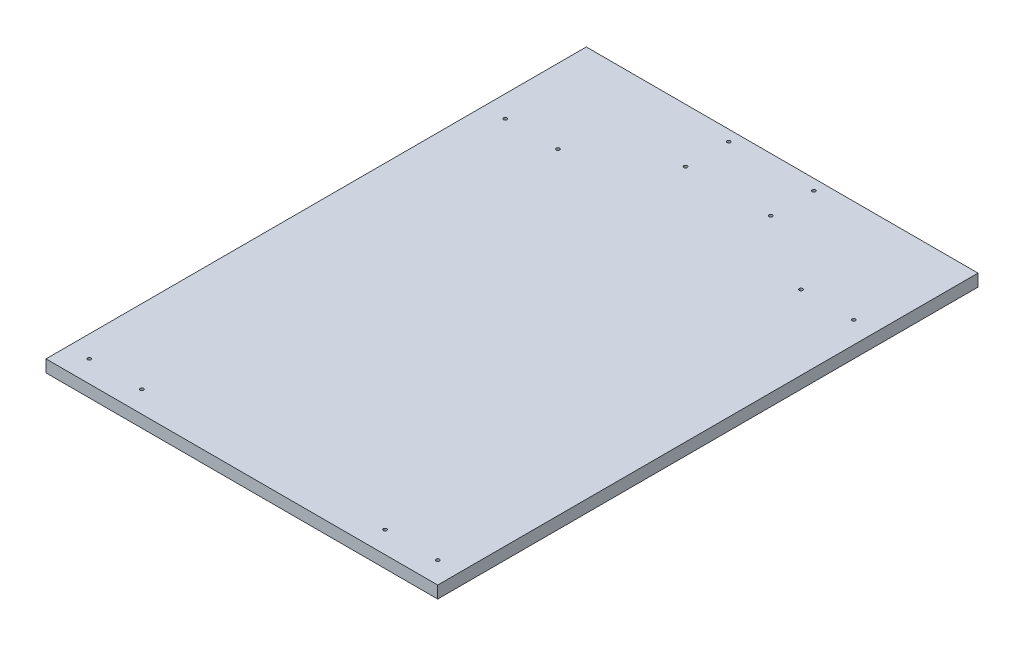
ISO-10303-21;
HEADER;
FILE_DESCRIPTION(('STEP AP214'),'2;1');
FILE_NAME('part.step','',(''),(''),'','','');
FILE_SCHEMA(('AUTOMOTIVE_DESIGN { 1 0 10303 214 1 1 1 1 }'));
ENDSEC;
DATA;
#1=APPLICATION_CONTEXT('core data for automotive mechanical design processes');
#2=APPLICATION_PROTOCOL_DEFINITION('international standard','automotive_design',2000,#1);
#3=PRODUCT_CONTEXT('',#1,'mechanical');
#4=PRODUCT('Part','Part','',(#3));
#5=PRODUCT_RELATED_PRODUCT_CATEGORY('part','',(#4));
#6=PRODUCT_DEFINITION_FORMATION('','',#4);
#7=PRODUCT_DEFINITION_CONTEXT('part definition',#1,'design');
#8=PRODUCT_DEFINITION('design','',#6,#7);
#9=PRODUCT_DEFINITION_SHAPE('','',#8);
#10=(LENGTH_UNIT() NAMED_UNIT(*) SI_UNIT(.MILLI.,.METRE.));
#11=(NAMED_UNIT(*) PLANE_ANGLE_UNIT() SI_UNIT($,.RADIAN.));
#12=(NAMED_UNIT(*) SI_UNIT($,.STERADIAN.) SOLID_ANGLE_UNIT());
#13=UNCERTAINTY_MEASURE_WITH_UNIT(LENGTH_MEASURE(1.E-05),#10,'distance_accuracy_value','');
#14=(GEOMETRIC_REPRESENTATION_CONTEXT(3) GLOBAL_UNCERTAINTY_ASSIGNED_CONTEXT((#13)) GLOBAL_UNIT_ASSIGNED_CONTEXT((#10,
#11,#12)) REPRESENTATION_CONTEXT('',''));
#15=CARTESIAN_POINT('',(0.,0.,0.));
#16=DIRECTION('',(0.,0.,1.));
#17=DIRECTION('',(1.,0.,0.));
#18=AXIS2_PLACEMENT_3D('',#15,#16,#17);
#19=CARTESIAN_POINT('',(0.,9.,0.));
#20=DIRECTION('',(1.,0.,0.));
#21=DIRECTION('',(0.,0.,-1.));
#22=AXIS2_PLACEMENT_3D('',#19,#20,#21);
#23=PLANE('',#22);
#24=DIRECTION('',(0.,0.,1.));
#25=VECTOR('',#24,1.);
#26=CARTESIAN_POINT('',(0.,0.,0.));
#27=LINE('',#26,#25);
#28=CARTESIAN_POINT('',(0.,0.,-400.));
#29=VERTEX_POINT('',#28);
#30=CARTESIAN_POINT('',(0.,0.,0.));
#31=VERTEX_POINT('',#30);
#32=EDGE_CURVE('E96',#29,#31,#27,.T.);
#33=ORIENTED_EDGE('',*,*,#32,.T.);
#34=DIRECTION('',(0.,-1.,0.));
#35=VECTOR('',#34,1.);
#36=CARTESIAN_POINT('',(0.,9.,0.));
#37=LINE('',#36,#35);
#38=CARTESIAN_POINT('',(0.,9.,0.));
#39=VERTEX_POINT('',#38);
#40=EDGE_CURVE('E11',#39,#31,#37,.T.);
#41=ORIENTED_EDGE('',*,*,#40,.F.);
#42=DIRECTION('',(0.,0.,1.));
#43=VECTOR('',#42,1.);
#44=CARTESIAN_POINT('',(0.,9.,0.));
#45=LINE('',#44,#43);
#46=CARTESIAN_POINT('',(0.,9.,-400.));
#47=VERTEX_POINT('',#46);
#48=EDGE_CURVE('E84',#47,#39,#45,.T.);
#49=ORIENTED_EDGE('',*,*,#48,.F.);
#50=DIRECTION('',(0.,-1.,0.));
#51=VECTOR('',#50,1.);
#52=CARTESIAN_POINT('',(0.,9.,-400.));
#53=LINE('',#52,#51);
#54=EDGE_CURVE('E92',#47,#29,#53,.T.);
#55=ORIENTED_EDGE('',*,*,#54,.T.);
#56=EDGE_LOOP('',(#33,#41,#49,#55));
#57=FACE_BOUND('',#56,.T.);
#58=ADVANCED_FACE('F33',(#57),#23,.F.);
#59=CARTESIAN_POINT('',(0.,9.,0.));
#60=DIRECTION('',(0.,0.,-1.));
#61=DIRECTION('',(-1.,0.,0.));
#62=AXIS2_PLACEMENT_3D('',#59,#60,#61);
#63=PLANE('',#62);
#64=DIRECTION('',(1.,0.,0.));
#65=VECTOR('',#64,1.);
#66=CARTESIAN_POINT('',(0.,0.,0.));
#67=LINE('',#66,#65);
#68=CARTESIAN_POINT('',(290.,0.,0.));
#69=VERTEX_POINT('',#68);
#70=EDGE_CURVE('E88',#31,#69,#67,.T.);
#71=ORIENTED_EDGE('',*,*,#70,.T.);
#72=DIRECTION('',(0.,-1.,0.));
#73=VECTOR('',#72,1.);
#74=CARTESIAN_POINT('',(290.,9.,0.));
#75=LINE('',#74,#73);
#76=CARTESIAN_POINT('',(290.,9.,0.));
#77=VERTEX_POINT('',#76);
#78=EDGE_CURVE('E41',#77,#69,#75,.T.);
#79=ORIENTED_EDGE('',*,*,#78,.F.);
#80=DIRECTION('',(1.,0.,0.));
#81=VECTOR('',#80,1.);
#82=CARTESIAN_POINT('',(0.,9.,0.));
#83=LINE('',#82,#81);
#84=EDGE_CURVE('E79',#39,#77,#83,.T.);
#85=ORIENTED_EDGE('',*,*,#84,.F.);
#86=ORIENTED_EDGE('',*,*,#40,.T.);
#87=EDGE_LOOP('',(#71,#79,#85,#86));
#88=FACE_BOUND('',#87,.T.);
#89=ADVANCED_FACE('F87',(#88),#63,.F.);
#90=CARTESIAN_POINT('',(290.,9.,0.));
#91=DIRECTION('',(-1.,0.,0.));
#92=DIRECTION('',(0.,0.,1.));
#93=AXIS2_PLACEMENT_3D('',#90,#91,#92);
#94=PLANE('',#93);
#95=DIRECTION('',(0.,0.,-1.));
#96=VECTOR('',#95,1.);
#97=CARTESIAN_POINT('',(290.,0.,0.));
#98=LINE('',#97,#96);
#99=CARTESIAN_POINT('',(290.,0.,-400.));
#100=VERTEX_POINT('',#99);
#101=EDGE_CURVE('E66',#69,#100,#98,.T.);
#102=ORIENTED_EDGE('',*,*,#101,.T.);
#103=DIRECTION('',(0.,-1.,0.));
#104=VECTOR('',#103,1.);
#105=CARTESIAN_POINT('',(290.,9.,-400.));
#106=LINE('',#105,#104);
#107=CARTESIAN_POINT('',(290.,9.,-400.));
#108=VERTEX_POINT('',#107);
#109=EDGE_CURVE('E89',#108,#100,#106,.T.);
#110=ORIENTED_EDGE('',*,*,#109,.F.);
#111=DIRECTION('',(0.,0.,-1.));
#112=VECTOR('',#111,1.);
#113=CARTESIAN_POINT('',(290.,9.,0.));
#114=LINE('',#113,#112);
#115=EDGE_CURVE('E82',#77,#108,#114,.T.);
#116=ORIENTED_EDGE('',*,*,#115,.F.);
#117=ORIENTED_EDGE('',*,*,#78,.T.);
#118=EDGE_LOOP('',(#102,#110,#116,#117));
#119=FACE_BOUND('',#118,.T.);
#120=ADVANCED_FACE('F90',(#119),#94,.F.);
#121=CARTESIAN_POINT('',(0.,9.,-400.));
#122=DIRECTION('',(0.,0.,1.));
#123=DIRECTION('',(1.,0.,0.));
#124=AXIS2_PLACEMENT_3D('',#121,#122,#123);
#125=PLANE('',#124);
#126=DIRECTION('',(-1.,0.,0.));
#127=VECTOR('',#126,1.);
#128=CARTESIAN_POINT('',(0.,0.,-400.));
#129=LINE('',#128,#127);
#130=EDGE_CURVE('E72',#100,#29,#129,.T.);
#131=ORIENTED_EDGE('',*,*,#130,.T.);
#132=ORIENTED_EDGE('',*,*,#54,.F.);
#133=DIRECTION('',(-1.,0.,0.));
#134=VECTOR('',#133,1.);
#135=CARTESIAN_POINT('',(0.,9.,-400.));
#136=LINE('',#135,#134);
#137=EDGE_CURVE('E49',#108,#47,#136,.T.);
#138=ORIENTED_EDGE('',*,*,#137,.F.);
#139=ORIENTED_EDGE('',*,*,#109,.T.);
#140=EDGE_LOOP('',(#131,#132,#138,#139));
#141=FACE_BOUND('',#140,.T.);
#142=ADVANCED_FACE('F104',(#141),#125,.F.);
#143=CARTESIAN_POINT('',(0.,9.,0.));
#144=DIRECTION('',(0.,-1.,0.));
#145=DIRECTION('',(0.,0.,-1.));
#146=AXIS2_PLACEMENT_3D('',#143,#144,#145);
#147=PLANE('',#146);
#148=CARTESIAN_POINT('',(176.499999999998,9.,-392.));
#149=DIRECTION('',(0.,1.,0.));
#150=DIRECTION('',(0.,0.,1.));
#151=AXIS2_PLACEMENT_3D('',#148,#149,#150);
#152=CIRCLE('',#151,1.25000000000001);
#153=CARTESIAN_POINT('',(176.499999999998,9.,-390.75));
#154=VERTEX_POINT('',#153);
#155=EDGE_CURVE('E176',#154,#154,#152,.T.);
#156=ORIENTED_EDGE('',*,*,#155,.F.);
#157=EDGE_LOOP('',(#156));
#158=FACE_BOUND('',#157,.T.);
#159=CARTESIAN_POINT('',(176.499999999999,9.,-360.));
#160=DIRECTION('',(0.,1.,0.));
#161=DIRECTION('',(0.,0.,1.));
#162=AXIS2_PLACEMENT_3D('',#159,#160,#161);
#163=CIRCLE('',#162,1.24999999999998);
#164=CARTESIAN_POINT('',(176.499999999999,9.,-358.75));
#165=VERTEX_POINT('',#164);
#166=EDGE_CURVE('E170',#165,#165,#163,.T.);
#167=ORIENTED_EDGE('',*,*,#166,.F.);
#168=EDGE_LOOP('',(#167));
#169=FACE_BOUND('',#168,.T.);
#170=CARTESIAN_POINT('',(113.499999999999,9.,-360.));
#171=DIRECTION('',(0.,1.,0.));
#172=DIRECTION('',(0.,0.,1.));
#173=AXIS2_PLACEMENT_3D('',#170,#171,#172);
#174=CIRCLE('',#173,1.25000000000001);
#175=CARTESIAN_POINT('',(113.499999999999,9.,-358.749999999999));
#176=VERTEX_POINT('',#175);
#177=EDGE_CURVE('E164',#176,#176,#174,.T.);
#178=ORIENTED_EDGE('',*,*,#177,.F.);
#179=EDGE_LOOP('',(#178));
#180=FACE_BOUND('',#179,.T.);
#181=CARTESIAN_POINT('',(113.499999999998,9.,-391.999999999999));
#182=DIRECTION('',(0.,1.,0.));
#183=DIRECTION('',(0.,0.,1.));
#184=AXIS2_PLACEMENT_3D('',#181,#182,#183);
#185=CIRCLE('',#184,1.25000000000001);
#186=CARTESIAN_POINT('',(113.499999999998,9.,-390.749999999999));
#187=VERTEX_POINT('',#186);
#188=EDGE_CURVE('E158',#187,#187,#185,.T.);
#189=ORIENTED_EDGE('',*,*,#188,.F.);
#190=EDGE_LOOP('',(#189));
#191=FACE_BOUND('',#190,.T.);
#192=CARTESIAN_POINT('',(235.,9.,-324.));
#193=DIRECTION('',(0.,1.,0.));
#194=DIRECTION('',(0.,0.,1.));
#195=AXIS2_PLACEMENT_3D('',#192,#193,#194);
#196=CIRCLE('',#195,1.25000000000001);
#197=CARTESIAN_POINT('',(235.,9.,-322.75));
#198=VERTEX_POINT('',#197);
#199=EDGE_CURVE('E152',#198,#198,#196,.T.);
#200=ORIENTED_EDGE('',*,*,#199,.F.);
#201=EDGE_LOOP('',(#200));
#202=FACE_BOUND('',#201,.T.);
#203=CARTESIAN_POINT('',(274.,9.,-324.));
#204=DIRECTION('',(0.,1.,0.));
#205=DIRECTION('',(0.,0.,1.));
#206=AXIS2_PLACEMENT_3D('',#203,#204,#205);
#207=CIRCLE('',#206,1.25000000000001);
#208=CARTESIAN_POINT('',(274.,9.,-322.75));
#209=VERTEX_POINT('',#208);
#210=EDGE_CURVE('E146',#209,#209,#207,.T.);
#211=ORIENTED_EDGE('',*,*,#210,.F.);
#212=EDGE_LOOP('',(#211));
#213=FACE_BOUND('',#212,.T.);
#214=CARTESIAN_POINT('',(55.,9.,-324.));
#215=DIRECTION('',(0.,1.,0.));
#216=DIRECTION('',(0.,0.,1.));
#217=AXIS2_PLACEMENT_3D('',#214,#215,#216);
#218=CIRCLE('',#217,1.25);
#219=CARTESIAN_POINT('',(55.,9.,-322.75));
#220=VERTEX_POINT('',#219);
#221=EDGE_CURVE('E140',#220,#220,#218,.T.);
#222=ORIENTED_EDGE('',*,*,#221,.F.);
#223=EDGE_LOOP('',(#222));
#224=FACE_BOUND('',#223,.T.);
#225=CARTESIAN_POINT('',(16.,9.,-324.));
#226=DIRECTION('',(0.,1.,0.));
#227=DIRECTION('',(0.,0.,1.));
#228=AXIS2_PLACEMENT_3D('',#225,#226,#227);
#229=CIRCLE('',#228,1.25000000000001);
#230=CARTESIAN_POINT('',(16.,9.,-322.75));
#231=VERTEX_POINT('',#230);
#232=EDGE_CURVE('E134',#231,#231,#229,.T.);
#233=ORIENTED_EDGE('',*,*,#232,.F.);
#234=EDGE_LOOP('',(#233));
#235=FACE_BOUND('',#234,.T.);
#236=CARTESIAN_POINT('',(274.,9.,-16.));
#237=DIRECTION('',(0.,1.,0.));
#238=DIRECTION('',(0.,0.,1.));
#239=AXIS2_PLACEMENT_3D('',#236,#237,#238);
#240=CIRCLE('',#239,1.25000000000001);
#241=CARTESIAN_POINT('',(274.,9.,-14.75));
#242=VERTEX_POINT('',#241);
#243=EDGE_CURVE('E128',#242,#242,#240,.T.);
#244=ORIENTED_EDGE('',*,*,#243,.F.);
#245=EDGE_LOOP('',(#244));
#246=FACE_BOUND('',#245,.T.);
#247=CARTESIAN_POINT('',(235.,9.,-16.));
#248=DIRECTION('',(0.,1.,0.));
#249=DIRECTION('',(0.,0.,1.));
#250=AXIS2_PLACEMENT_3D('',#247,#248,#249);
#251=CIRCLE('',#250,1.25000000000001);
#252=CARTESIAN_POINT('',(235.,9.,-14.75));
#253=VERTEX_POINT('',#252);
#254=EDGE_CURVE('E122',#253,#253,#251,.T.);
#255=ORIENTED_EDGE('',*,*,#254,.F.);
#256=EDGE_LOOP('',(#255));
#257=FACE_BOUND('',#256,.T.);
#258=CARTESIAN_POINT('',(55.,9.,-16.));
#259=DIRECTION('',(0.,1.,0.));
#260=DIRECTION('',(0.,0.,1.));
#261=AXIS2_PLACEMENT_3D('',#258,#259,#260);
#262=CIRCLE('',#261,1.25);
#263=CARTESIAN_POINT('',(55.,9.,-14.75));
#264=VERTEX_POINT('',#263);
#265=EDGE_CURVE('E116',#264,#264,#262,.T.);
#266=ORIENTED_EDGE('',*,*,#265,.F.);
#267=EDGE_LOOP('',(#266));
#268=FACE_BOUND('',#267,.T.);
#269=CARTESIAN_POINT('',(16.,9.,-16.));
#270=DIRECTION('',(0.,1.,0.));
#271=DIRECTION('',(0.,0.,1.));
#272=AXIS2_PLACEMENT_3D('',#269,#270,#271);
#273=CIRCLE('',#272,1.25);
#274=CARTESIAN_POINT('',(16.,9.,-14.75));
#275=VERTEX_POINT('',#274);
#276=EDGE_CURVE('E110',#275,#275,#273,.T.);
#277=ORIENTED_EDGE('',*,*,#276,.F.);
#278=EDGE_LOOP('',(#277));
#279=FACE_BOUND('',#278,.T.);
#280=ORIENTED_EDGE('',*,*,#48,.T.);
#281=ORIENTED_EDGE('',*,*,#84,.T.);
#282=ORIENTED_EDGE('',*,*,#115,.T.);
#283=ORIENTED_EDGE('',*,*,#137,.T.);
#284=EDGE_LOOP('',(#280,#281,#282,#283));
#285=FACE_BOUND('',#284,.T.);
#286=ADVANCED_FACE('F80',(#158,#169,#180,#191,#202,#213,#224,#235,#246,#257,#268,#279,#285),
#147,.F.);
#287=CARTESIAN_POINT('',(0.,0.,0.));
#288=DIRECTION('',(0.,-1.,0.));
#289=DIRECTION('',(0.,0.,-1.));
#290=AXIS2_PLACEMENT_3D('',#287,#288,#289);
#291=PLANE('',#290);
#292=CARTESIAN_POINT('',(176.499999999998,0.,-392.));
#293=DIRECTION('',(0.,1.,0.));
#294=DIRECTION('',(0.,0.,1.));
#295=AXIS2_PLACEMENT_3D('',#292,#293,#294);
#296=CIRCLE('',#295,1.25000000000001);
#297=CARTESIAN_POINT('',(176.499999999998,0.,-390.75));
#298=VERTEX_POINT('',#297);
#299=EDGE_CURVE('E173',#298,#298,#296,.T.);
#300=ORIENTED_EDGE('',*,*,#299,.T.);
#301=EDGE_LOOP('',(#300));
#302=FACE_BOUND('',#301,.T.);
#303=CARTESIAN_POINT('',(176.499999999999,0.,-360.));
#304=DIRECTION('',(0.,1.,0.));
#305=DIRECTION('',(0.,0.,1.));
#306=AXIS2_PLACEMENT_3D('',#303,#304,#305);
#307=CIRCLE('',#306,1.24999999999998);
#308=CARTESIAN_POINT('',(176.499999999999,0.,-358.75));
#309=VERTEX_POINT('',#308);
#310=EDGE_CURVE('E167',#309,#309,#307,.T.);
#311=ORIENTED_EDGE('',*,*,#310,.T.);
#312=EDGE_LOOP('',(#311));
#313=FACE_BOUND('',#312,.T.);
#314=CARTESIAN_POINT('',(113.499999999999,0.,-360.));
#315=DIRECTION('',(0.,1.,0.));
#316=DIRECTION('',(0.,0.,1.));
#317=AXIS2_PLACEMENT_3D('',#314,#315,#316);
#318=CIRCLE('',#317,1.25000000000001);
#319=CARTESIAN_POINT('',(113.499999999999,0.,-358.749999999999));
#320=VERTEX_POINT('',#319);
#321=EDGE_CURVE('E161',#320,#320,#318,.T.);
#322=ORIENTED_EDGE('',*,*,#321,.T.);
#323=EDGE_LOOP('',(#322));
#324=FACE_BOUND('',#323,.T.);
#325=CARTESIAN_POINT('',(113.499999999998,0.,-391.999999999999));
#326=DIRECTION('',(0.,1.,0.));
#327=DIRECTION('',(0.,0.,1.));
#328=AXIS2_PLACEMENT_3D('',#325,#326,#327);
#329=CIRCLE('',#328,1.25000000000001);
#330=CARTESIAN_POINT('',(113.499999999998,0.,-390.749999999999));
#331=VERTEX_POINT('',#330);
#332=EDGE_CURVE('E155',#331,#331,#329,.T.);
#333=ORIENTED_EDGE('',*,*,#332,.T.);
#334=EDGE_LOOP('',(#333));
#335=FACE_BOUND('',#334,.T.);
#336=CARTESIAN_POINT('',(235.,0.,-324.));
#337=DIRECTION('',(0.,1.,0.));
#338=DIRECTION('',(0.,0.,1.));
#339=AXIS2_PLACEMENT_3D('',#336,#337,#338);
#340=CIRCLE('',#339,1.25000000000001);
#341=CARTESIAN_POINT('',(235.,0.,-322.75));
#342=VERTEX_POINT('',#341);
#343=EDGE_CURVE('E149',#342,#342,#340,.T.);
#344=ORIENTED_EDGE('',*,*,#343,.T.);
#345=EDGE_LOOP('',(#344));
#346=FACE_BOUND('',#345,.T.);
#347=CARTESIAN_POINT('',(274.,0.,-324.));
#348=DIRECTION('',(0.,1.,0.));
#349=DIRECTION('',(0.,0.,1.));
#350=AXIS2_PLACEMENT_3D('',#347,#348,#349);
#351=CIRCLE('',#350,1.25000000000001);
#352=CARTESIAN_POINT('',(274.,0.,-322.75));
#353=VERTEX_POINT('',#352);
#354=EDGE_CURVE('E143',#353,#353,#351,.T.);
#355=ORIENTED_EDGE('',*,*,#354,.T.);
#356=EDGE_LOOP('',(#355));
#357=FACE_BOUND('',#356,.T.);
#358=CARTESIAN_POINT('',(55.,0.,-324.));
#359=DIRECTION('',(0.,1.,0.));
#360=DIRECTION('',(0.,0.,1.));
#361=AXIS2_PLACEMENT_3D('',#358,#359,#360);
#362=CIRCLE('',#361,1.25);
#363=CARTESIAN_POINT('',(55.,0.,-322.75));
#364=VERTEX_POINT('',#363);
#365=EDGE_CURVE('E137',#364,#364,#362,.T.);
#366=ORIENTED_EDGE('',*,*,#365,.T.);
#367=EDGE_LOOP('',(#366));
#368=FACE_BOUND('',#367,.T.);
#369=CARTESIAN_POINT('',(16.,0.,-324.));
#370=DIRECTION('',(0.,1.,0.));
#371=DIRECTION('',(0.,0.,1.));
#372=AXIS2_PLACEMENT_3D('',#369,#370,#371);
#373=CIRCLE('',#372,1.25000000000001);
#374=CARTESIAN_POINT('',(16.,0.,-322.75));
#375=VERTEX_POINT('',#374);
#376=EDGE_CURVE('E131',#375,#375,#373,.T.);
#377=ORIENTED_EDGE('',*,*,#376,.T.);
#378=EDGE_LOOP('',(#377));
#379=FACE_BOUND('',#378,.T.);
#380=CARTESIAN_POINT('',(274.,0.,-16.));
#381=DIRECTION('',(0.,1.,0.));
#382=DIRECTION('',(0.,0.,1.));
#383=AXIS2_PLACEMENT_3D('',#380,#381,#382);
#384=CIRCLE('',#383,1.25000000000001);
#385=CARTESIAN_POINT('',(274.,0.,-14.75));
#386=VERTEX_POINT('',#385);
#387=EDGE_CURVE('E125',#386,#386,#384,.T.);
#388=ORIENTED_EDGE('',*,*,#387,.T.);
#389=EDGE_LOOP('',(#388));
#390=FACE_BOUND('',#389,.T.);
#391=CARTESIAN_POINT('',(235.,0.,-16.));
#392=DIRECTION('',(0.,1.,0.));
#393=DIRECTION('',(0.,0.,1.));
#394=AXIS2_PLACEMENT_3D('',#391,#392,#393);
#395=CIRCLE('',#394,1.25000000000001);
#396=CARTESIAN_POINT('',(235.,0.,-14.75));
#397=VERTEX_POINT('',#396);
#398=EDGE_CURVE('E119',#397,#397,#395,.T.);
#399=ORIENTED_EDGE('',*,*,#398,.T.);
#400=EDGE_LOOP('',(#399));
#401=FACE_BOUND('',#400,.T.);
#402=CARTESIAN_POINT('',(55.,0.,-16.));
#403=DIRECTION('',(0.,1.,0.));
#404=DIRECTION('',(0.,0.,1.));
#405=AXIS2_PLACEMENT_3D('',#402,#403,#404);
#406=CIRCLE('',#405,1.25);
#407=CARTESIAN_POINT('',(55.,0.,-14.75));
#408=VERTEX_POINT('',#407);
#409=EDGE_CURVE('E113',#408,#408,#406,.T.);
#410=ORIENTED_EDGE('',*,*,#409,.T.);
#411=EDGE_LOOP('',(#410));
#412=FACE_BOUND('',#411,.T.);
#413=CARTESIAN_POINT('',(16.,0.,-16.));
#414=DIRECTION('',(0.,1.,0.));
#415=DIRECTION('',(0.,0.,1.));
#416=AXIS2_PLACEMENT_3D('',#413,#414,#415);
#417=CIRCLE('',#416,1.25);
#418=CARTESIAN_POINT('',(16.,0.,-14.75));
#419=VERTEX_POINT('',#418);
#420=EDGE_CURVE('E99',#419,#419,#417,.T.);
#421=ORIENTED_EDGE('',*,*,#420,.T.);
#422=EDGE_LOOP('',(#421));
#423=FACE_BOUND('',#422,.T.);
#424=ORIENTED_EDGE('',*,*,#32,.F.);
#425=ORIENTED_EDGE('',*,*,#130,.F.);
#426=ORIENTED_EDGE('',*,*,#101,.F.);
#427=ORIENTED_EDGE('',*,*,#70,.F.);
#428=EDGE_LOOP('',(#424,#425,#426,#427));
#429=FACE_BOUND('',#428,.T.);
#430=ADVANCED_FACE('F107',(#302,#313,#324,#335,#346,#357,#368,#379,#390,#401,#412,#423,#429),
#291,.T.);
#431=CARTESIAN_POINT('',(16.,0.,-16.));
#432=DIRECTION('',(0.,1.,0.));
#433=DIRECTION('',(0.,0.,1.));
#434=AXIS2_PLACEMENT_3D('',#431,#432,#433);
#435=CYLINDRICAL_SURFACE('',#434,1.25);
#436=ORIENTED_EDGE('',*,*,#420,.F.);
#437=EDGE_LOOP('',(#436));
#438=FACE_BOUND('',#437,.T.);
#439=ORIENTED_EDGE('',*,*,#276,.T.);
#440=EDGE_LOOP('',(#439));
#441=FACE_BOUND('',#440,.T.);
#442=ADVANCED_FACE('F216',(#438,#441),#435,.F.);
#443=CARTESIAN_POINT('',(55.,0.,-16.));
#444=DIRECTION('',(0.,1.,0.));
#445=DIRECTION('',(0.,0.,1.));
#446=AXIS2_PLACEMENT_3D('',#443,#444,#445);
#447=CYLINDRICAL_SURFACE('',#446,1.25);
#448=ORIENTED_EDGE('',*,*,#409,.F.);
#449=EDGE_LOOP('',(#448));
#450=FACE_BOUND('',#449,.T.);
#451=ORIENTED_EDGE('',*,*,#265,.T.);
#452=EDGE_LOOP('',(#451));
#453=FACE_BOUND('',#452,.T.);
#454=ADVANCED_FACE('F218',(#450,#453),#447,.F.);
#455=CARTESIAN_POINT('',(235.,0.,-16.));
#456=DIRECTION('',(0.,1.,0.));
#457=DIRECTION('',(0.,0.,1.));
#458=AXIS2_PLACEMENT_3D('',#455,#456,#457);
#459=CYLINDRICAL_SURFACE('',#458,1.25000000000001);
#460=ORIENTED_EDGE('',*,*,#398,.F.);
#461=EDGE_LOOP('',(#460));
#462=FACE_BOUND('',#461,.T.);
#463=ORIENTED_EDGE('',*,*,#254,.T.);
#464=EDGE_LOOP('',(#463));
#465=FACE_BOUND('',#464,.T.);
#466=ADVANCED_FACE('F225',(#462,#465),#459,.F.);
#467=CARTESIAN_POINT('',(274.,0.,-16.));
#468=DIRECTION('',(0.,1.,0.));
#469=DIRECTION('',(0.,0.,1.));
#470=AXIS2_PLACEMENT_3D('',#467,#468,#469);
#471=CYLINDRICAL_SURFACE('',#470,1.25000000000001);
#472=ORIENTED_EDGE('',*,*,#387,.F.);
#473=EDGE_LOOP('',(#472));
#474=FACE_BOUND('',#473,.T.);
#475=ORIENTED_EDGE('',*,*,#243,.T.);
#476=EDGE_LOOP('',(#475));
#477=FACE_BOUND('',#476,.T.);
#478=ADVANCED_FACE('F273',(#474,#477),#471,.F.);
#479=CARTESIAN_POINT('',(16.,0.,-324.));
#480=DIRECTION('',(0.,1.,0.));
#481=DIRECTION('',(0.,0.,1.));
#482=AXIS2_PLACEMENT_3D('',#479,#480,#481);
#483=CYLINDRICAL_SURFACE('',#482,1.25000000000001);
#484=ORIENTED_EDGE('',*,*,#376,.F.);
#485=EDGE_LOOP('',(#484));
#486=FACE_BOUND('',#485,.T.);
#487=ORIENTED_EDGE('',*,*,#232,.T.);
#488=EDGE_LOOP('',(#487));
#489=FACE_BOUND('',#488,.T.);
#490=ADVANCED_FACE('F283',(#486,#489),#483,.F.);
#491=CARTESIAN_POINT('',(55.,0.,-324.));
#492=DIRECTION('',(0.,1.,0.));
#493=DIRECTION('',(0.,0.,1.));
#494=AXIS2_PLACEMENT_3D('',#491,#492,#493);
#495=CYLINDRICAL_SURFACE('',#494,1.25);
#496=ORIENTED_EDGE('',*,*,#365,.F.);
#497=EDGE_LOOP('',(#496));
#498=FACE_BOUND('',#497,.T.);
#499=ORIENTED_EDGE('',*,*,#221,.T.);
#500=EDGE_LOOP('',(#499));
#501=FACE_BOUND('',#500,.T.);
#502=ADVANCED_FACE('F293',(#498,#501),#495,.F.);
#503=CARTESIAN_POINT('',(274.,0.,-324.));
#504=DIRECTION('',(0.,1.,0.));
#505=DIRECTION('',(0.,0.,1.));
#506=AXIS2_PLACEMENT_3D('',#503,#504,#505);
#507=CYLINDRICAL_SURFACE('',#506,1.25000000000001);
#508=ORIENTED_EDGE('',*,*,#354,.F.);
#509=EDGE_LOOP('',(#508));
#510=FACE_BOUND('',#509,.T.);
#511=ORIENTED_EDGE('',*,*,#210,.T.);
#512=EDGE_LOOP('',(#511));
#513=FACE_BOUND('',#512,.T.);
#514=ADVANCED_FACE('F303',(#510,#513),#507,.F.);
#515=CARTESIAN_POINT('',(235.,0.,-324.));
#516=DIRECTION('',(0.,1.,0.));
#517=DIRECTION('',(0.,0.,1.));
#518=AXIS2_PLACEMENT_3D('',#515,#516,#517);
#519=CYLINDRICAL_SURFACE('',#518,1.25000000000001);
#520=ORIENTED_EDGE('',*,*,#343,.F.);
#521=EDGE_LOOP('',(#520));
#522=FACE_BOUND('',#521,.T.);
#523=ORIENTED_EDGE('',*,*,#199,.T.);
#524=EDGE_LOOP('',(#523));
#525=FACE_BOUND('',#524,.T.);
#526=ADVANCED_FACE('F313',(#522,#525),#519,.F.);
#527=CARTESIAN_POINT('',(113.499999999998,0.,-391.999999999999));
#528=DIRECTION('',(0.,1.,0.));
#529=DIRECTION('',(0.,0.,1.));
#530=AXIS2_PLACEMENT_3D('',#527,#528,#529);
#531=CYLINDRICAL_SURFACE('',#530,1.25000000000001);
#532=ORIENTED_EDGE('',*,*,#332,.F.);
#533=EDGE_LOOP('',(#532));
#534=FACE_BOUND('',#533,.T.);
#535=ORIENTED_EDGE('',*,*,#188,.T.);
#536=EDGE_LOOP('',(#535));
#537=FACE_BOUND('',#536,.T.);
#538=ADVANCED_FACE('F323',(#534,#537),#531,.F.);
#539=CARTESIAN_POINT('',(113.499999999999,0.,-360.));
#540=DIRECTION('',(0.,1.,0.));
#541=DIRECTION('',(0.,0.,1.));
#542=AXIS2_PLACEMENT_3D('',#539,#540,#541);
#543=CYLINDRICAL_SURFACE('',#542,1.25000000000001);
#544=ORIENTED_EDGE('',*,*,#321,.F.);
#545=EDGE_LOOP('',(#544));
#546=FACE_BOUND('',#545,.T.);
#547=ORIENTED_EDGE('',*,*,#177,.T.);
#548=EDGE_LOOP('',(#547));
#549=FACE_BOUND('',#548,.T.);
#550=ADVANCED_FACE('F333',(#546,#549),#543,.F.);
#551=CARTESIAN_POINT('',(176.499999999999,0.,-360.));
#552=DIRECTION('',(0.,1.,0.));
#553=DIRECTION('',(0.,0.,1.));
#554=AXIS2_PLACEMENT_3D('',#551,#552,#553);
#555=CYLINDRICAL_SURFACE('',#554,1.24999999999998);
#556=ORIENTED_EDGE('',*,*,#310,.F.);
#557=EDGE_LOOP('',(#556));
#558=FACE_BOUND('',#557,.T.);
#559=ORIENTED_EDGE('',*,*,#166,.T.);
#560=EDGE_LOOP('',(#559));
#561=FACE_BOUND('',#560,.T.);
#562=ADVANCED_FACE('F187',(#558,#561),#555,.F.);
#563=CARTESIAN_POINT('',(176.499999999998,0.,-392.));
#564=DIRECTION('',(0.,1.,0.));
#565=DIRECTION('',(0.,0.,1.));
#566=AXIS2_PLACEMENT_3D('',#563,#564,#565);
#567=CYLINDRICAL_SURFACE('',#566,1.25000000000001);
#568=ORIENTED_EDGE('',*,*,#299,.F.);
#569=EDGE_LOOP('',(#568));
#570=FACE_BOUND('',#569,.T.);
#571=ORIENTED_EDGE('',*,*,#155,.T.);
#572=EDGE_LOOP('',(#571));
#573=FACE_BOUND('',#572,.T.);
#574=ADVANCED_FACE('F184',(#570,#573),#567,.F.);
#575=CLOSED_SHELL('',(#58,#89,#120,#142,#286,#430,#442,#454,#466,#478,#490,#502,#514,#526,#538,
#550,#562,#574));
#576=MANIFOLD_SOLID_BREP('B2',#575);
#577=ADVANCED_BREP_SHAPE_REPRESENTATION('',(#18,#576),#14);
#578=SHAPE_DEFINITION_REPRESENTATION(#9,#577);
ENDSEC;
END-ISO-10303-21;
